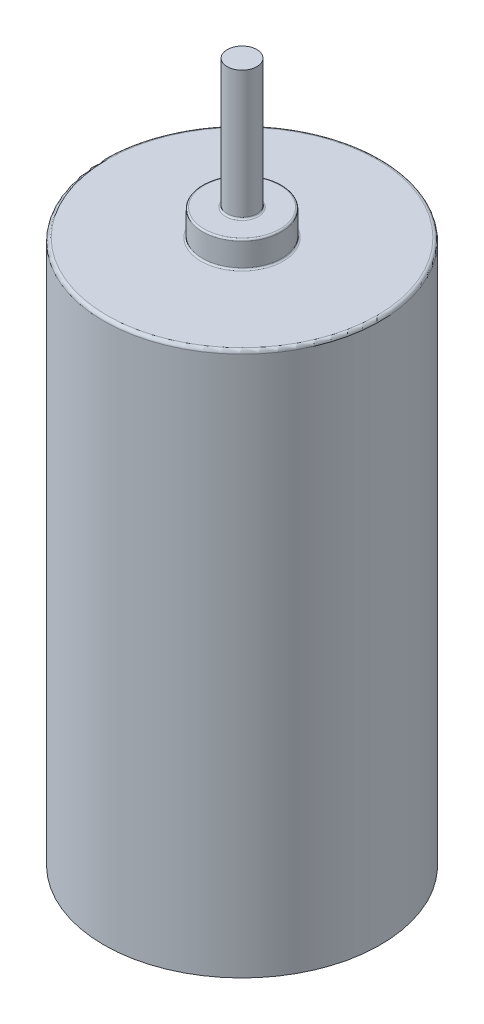
ISO-10303-21;
HEADER;
FILE_DESCRIPTION(('STEP AP214'),'2;1');
FILE_NAME('part.step','',(''),(''),'','','');
FILE_SCHEMA(('AUTOMOTIVE_DESIGN { 1 0 10303 214 1 1 1 1 }'));
ENDSEC;
DATA;
#1=APPLICATION_CONTEXT('core data for automotive mechanical design processes');
#2=APPLICATION_PROTOCOL_DEFINITION('international standard','automotive_design',2000,#1);
#3=PRODUCT_CONTEXT('',#1,'mechanical');
#4=PRODUCT('Part','Part','',(#3));
#5=PRODUCT_RELATED_PRODUCT_CATEGORY('part','',(#4));
#6=PRODUCT_DEFINITION_FORMATION('','',#4);
#7=PRODUCT_DEFINITION_CONTEXT('part definition',#1,'design');
#8=PRODUCT_DEFINITION('design','',#6,#7);
#9=PRODUCT_DEFINITION_SHAPE('','',#8);
#10=(LENGTH_UNIT() NAMED_UNIT(*) SI_UNIT(.MILLI.,.METRE.));
#11=(NAMED_UNIT(*) PLANE_ANGLE_UNIT() SI_UNIT($,.RADIAN.));
#12=(NAMED_UNIT(*) SI_UNIT($,.STERADIAN.) SOLID_ANGLE_UNIT());
#13=UNCERTAINTY_MEASURE_WITH_UNIT(LENGTH_MEASURE(1.E-05),#10,'distance_accuracy_value','');
#14=(GEOMETRIC_REPRESENTATION_CONTEXT(3) GLOBAL_UNCERTAINTY_ASSIGNED_CONTEXT((#13)) GLOBAL_UNIT_ASSIGNED_CONTEXT((#10,
#11,#12)) REPRESENTATION_CONTEXT('',''));
#15=CARTESIAN_POINT('',(0.,0.,0.));
#16=DIRECTION('',(0.,0.,1.));
#17=DIRECTION('',(1.,0.,0.));
#18=AXIS2_PLACEMENT_3D('',#15,#16,#17);
#19=CARTESIAN_POINT('',(0.,17.31,0.));
#20=DIRECTION('',(0.,1.,0.));
#21=DIRECTION('',(0.,0.,1.));
#22=AXIS2_PLACEMENT_3D('',#19,#20,#21);
#23=PLANE('',#22);
#24=CARTESIAN_POINT('',(0.,17.31,0.));
#25=DIRECTION('',(0.,1.,0.));
#26=DIRECTION('',(0.,0.,1.));
#27=AXIS2_PLACEMENT_3D('',#24,#25,#26);
#28=CIRCLE('',#27,0.5);
#29=CARTESIAN_POINT('',(0.,17.31,0.5));
#30=VERTEX_POINT('',#29);
#31=EDGE_CURVE('E42',#30,#30,#28,.F.);
#32=ORIENTED_EDGE('',*,*,#31,.T.);
#33=EDGE_LOOP('',(#32));
#34=FACE_BOUND('',#33,.T.);
#35=CARTESIAN_POINT('',(0.,17.31,0.));
#36=DIRECTION('',(0.,1.,0.));
#37=DIRECTION('',(0.,0.,1.));
#38=AXIS2_PLACEMENT_3D('',#35,#36,#37);
#39=CIRCLE('',#38,1.15);
#40=CARTESIAN_POINT('',(0.,17.31,1.15));
#41=VERTEX_POINT('',#40);
#42=EDGE_CURVE('E46',#41,#41,#39,.T.);
#43=ORIENTED_EDGE('',*,*,#42,.T.);
#44=EDGE_LOOP('',(#43));
#45=FACE_BOUND('',#44,.T.);
#46=ADVANCED_FACE('F31',(#34,#45),#23,.T.);
#47=CARTESIAN_POINT('',(0.,16.51,0.));
#48=DIRECTION('',(0.,1.,0.));
#49=DIRECTION('',(0.,0.,1.));
#50=AXIS2_PLACEMENT_3D('',#47,#48,#49);
#51=PLANE('',#50);
#52=CARTESIAN_POINT('',(0.,16.51,0.));
#53=DIRECTION('',(0.,1.,0.));
#54=DIRECTION('',(0.,0.,1.));
#55=AXIS2_PLACEMENT_3D('',#52,#53,#54);
#56=CIRCLE('',#55,4.1);
#57=CARTESIAN_POINT('',(0.,16.51,4.1));
#58=VERTEX_POINT('',#57);
#59=EDGE_CURVE('E38',#58,#58,#56,.T.);
#60=ORIENTED_EDGE('',*,*,#59,.T.);
#61=EDGE_LOOP('',(#60));
#62=FACE_BOUND('',#61,.T.);
#63=CARTESIAN_POINT('',(0.,16.51,0.));
#64=DIRECTION('',(0.,1.,0.));
#65=DIRECTION('',(0.,0.,1.));
#66=AXIS2_PLACEMENT_3D('',#63,#64,#65);
#67=CIRCLE('',#66,1.25);
#68=CARTESIAN_POINT('',(0.,16.51,1.25));
#69=VERTEX_POINT('',#68);
#70=EDGE_CURVE('E54',#69,#69,#67,.F.);
#71=ORIENTED_EDGE('',*,*,#70,.T.);
#72=EDGE_LOOP('',(#71));
#73=FACE_BOUND('',#72,.T.);
#74=ADVANCED_FACE('F88',(#62,#73),#51,.T.);
#75=CARTESIAN_POINT('',(0.,16.51,0.));
#76=DIRECTION('',(0.,-1.,0.));
#77=DIRECTION('',(0.,0.,-1.));
#78=AXIS2_PLACEMENT_3D('',#75,#76,#77);
#79=CYLINDRICAL_SURFACE('',#78,4.2);
#80=CARTESIAN_POINT('',(0.,16.41,0.));
#81=DIRECTION('',(0.,1.,0.));
#82=DIRECTION('',(0.,0.,1.));
#83=AXIS2_PLACEMENT_3D('',#80,#81,#82);
#84=CIRCLE('',#83,4.2);
#85=CARTESIAN_POINT('',(0.,16.41,4.2));
#86=VERTEX_POINT('',#85);
#87=EDGE_CURVE('E10',#86,#86,#84,.F.);
#88=ORIENTED_EDGE('',*,*,#87,.T.);
#89=EDGE_LOOP('',(#88));
#90=FACE_BOUND('',#89,.T.);
#91=CARTESIAN_POINT('',(0.,0.,0.));
#92=DIRECTION('',(0.,1.,0.));
#93=DIRECTION('',(0.,0.,1.));
#94=AXIS2_PLACEMENT_3D('',#91,#92,#93);
#95=CIRCLE('',#94,4.2);
#96=CARTESIAN_POINT('',(0.,0.,4.2));
#97=VERTEX_POINT('',#96);
#98=EDGE_CURVE('E63',#97,#97,#95,.T.);
#99=ORIENTED_EDGE('',*,*,#98,.T.);
#100=EDGE_LOOP('',(#99));
#101=FACE_BOUND('',#100,.T.);
#102=ADVANCED_FACE('F93',(#90,#101),#79,.T.);
#103=CARTESIAN_POINT('',(0.,0.,0.));
#104=DIRECTION('',(0.,1.,0.));
#105=DIRECTION('',(0.,0.,1.));
#106=AXIS2_PLACEMENT_3D('',#103,#104,#105);
#107=PLANE('',#106);
#108=ORIENTED_EDGE('',*,*,#98,.F.);
#109=EDGE_LOOP('',(#108));
#110=FACE_BOUND('',#109,.T.);
#111=ADVANCED_FACE('F83',(#110),#107,.F.);
#112=CARTESIAN_POINT('',(0.,17.31,0.));
#113=DIRECTION('',(0.,-1.,0.));
#114=DIRECTION('',(0.,0.,-1.));
#115=AXIS2_PLACEMENT_3D('',#112,#113,#114);
#116=CYLINDRICAL_SURFACE('',#115,1.2);
#117=CARTESIAN_POINT('',(0.,16.56,0.));
#118=DIRECTION('',(0.,1.,0.));
#119=DIRECTION('',(0.,0.,1.));
#120=AXIS2_PLACEMENT_3D('',#117,#118,#119);
#121=CIRCLE('',#120,1.2);
#122=CARTESIAN_POINT('',(0.,16.56,1.2));
#123=VERTEX_POINT('',#122);
#124=EDGE_CURVE('E57',#123,#123,#121,.T.);
#125=ORIENTED_EDGE('',*,*,#124,.T.);
#126=EDGE_LOOP('',(#125));
#127=FACE_BOUND('',#126,.T.);
#128=CARTESIAN_POINT('',(0.,17.26,0.));
#129=DIRECTION('',(0.,1.,0.));
#130=DIRECTION('',(0.,0.,1.));
#131=AXIS2_PLACEMENT_3D('',#128,#129,#130);
#132=CIRCLE('',#131,1.2);
#133=CARTESIAN_POINT('',(0.,17.26,1.2));
#134=VERTEX_POINT('',#133);
#135=EDGE_CURVE('E60',#134,#134,#132,.F.);
#136=ORIENTED_EDGE('',*,*,#135,.T.);
#137=EDGE_LOOP('',(#136));
#138=FACE_BOUND('',#137,.T.);
#139=ADVANCED_FACE('F74',(#127,#138),#116,.T.);
#140=CARTESIAN_POINT('',(0.,21.23,0.));
#141=DIRECTION('',(0.,-1.,0.));
#142=DIRECTION('',(0.,0.,-1.));
#143=AXIS2_PLACEMENT_3D('',#140,#141,#142);
#144=CYLINDRICAL_SURFACE('',#143,0.45);
#145=CARTESIAN_POINT('',(0.,17.36,0.));
#146=DIRECTION('',(0.,1.,0.));
#147=DIRECTION('',(0.,0.,1.));
#148=AXIS2_PLACEMENT_3D('',#145,#146,#147);
#149=CIRCLE('',#148,0.45);
#150=CARTESIAN_POINT('',(0.,17.36,0.45));
#151=VERTEX_POINT('',#150);
#152=EDGE_CURVE('E51',#151,#151,#149,.T.);
#153=ORIENTED_EDGE('',*,*,#152,.T.);
#154=EDGE_LOOP('',(#153));
#155=FACE_BOUND('',#154,.T.);
#156=CARTESIAN_POINT('',(0.,21.23,0.));
#157=DIRECTION('',(0.,1.,0.));
#158=DIRECTION('',(0.,0.,1.));
#159=AXIS2_PLACEMENT_3D('',#156,#157,#158);
#160=CIRCLE('',#159,0.45);
#161=CARTESIAN_POINT('',(0.,21.23,0.45));
#162=VERTEX_POINT('',#161);
#163=EDGE_CURVE('E66',#162,#162,#160,.T.);
#164=ORIENTED_EDGE('',*,*,#163,.F.);
#165=EDGE_LOOP('',(#164));
#166=FACE_BOUND('',#165,.T.);
#167=ADVANCED_FACE('F72',(#155,#166),#144,.T.);
#168=CARTESIAN_POINT('',(0.,21.23,0.));
#169=DIRECTION('',(0.,1.,0.));
#170=DIRECTION('',(0.,0.,1.));
#171=AXIS2_PLACEMENT_3D('',#168,#169,#170);
#172=PLANE('',#171);
#173=ORIENTED_EDGE('',*,*,#163,.T.);
#174=EDGE_LOOP('',(#173));
#175=FACE_BOUND('',#174,.T.);
#176=ADVANCED_FACE('F70',(#175),#172,.T.);
#177=CARTESIAN_POINT('',(0.,16.56,0.));
#178=DIRECTION('',(0.,1.,0.));
#179=DIRECTION('',(0.,0.,1.));
#180=AXIS2_PLACEMENT_3D('',#177,#178,#179);
#181=TOROIDAL_SURFACE('',#180,1.25,0.05);
#182=ORIENTED_EDGE('',*,*,#70,.F.);
#183=EDGE_LOOP('',(#182));
#184=FACE_BOUND('',#183,.T.);
#185=ORIENTED_EDGE('',*,*,#124,.F.);
#186=EDGE_LOOP('',(#185));
#187=FACE_BOUND('',#186,.T.);
#188=ADVANCED_FACE('F81',(#184,#187),#181,.F.);
#189=CARTESIAN_POINT('',(0.,17.36,0.));
#190=DIRECTION('',(0.,1.,0.));
#191=DIRECTION('',(0.,0.,1.));
#192=AXIS2_PLACEMENT_3D('',#189,#190,#191);
#193=TOROIDAL_SURFACE('',#192,0.5,0.05);
#194=ORIENTED_EDGE('',*,*,#31,.F.);
#195=EDGE_LOOP('',(#194));
#196=FACE_BOUND('',#195,.T.);
#197=ORIENTED_EDGE('',*,*,#152,.F.);
#198=EDGE_LOOP('',(#197));
#199=FACE_BOUND('',#198,.T.);
#200=ADVANCED_FACE('F104',(#196,#199),#193,.F.);
#201=CARTESIAN_POINT('',(0.,17.26,0.));
#202=DIRECTION('',(0.,1.,0.));
#203=DIRECTION('',(0.,0.,1.));
#204=AXIS2_PLACEMENT_3D('',#201,#202,#203);
#205=TOROIDAL_SURFACE('',#204,1.15,0.05);
#206=ORIENTED_EDGE('',*,*,#135,.F.);
#207=EDGE_LOOP('',(#206));
#208=FACE_BOUND('',#207,.T.);
#209=ORIENTED_EDGE('',*,*,#42,.F.);
#210=EDGE_LOOP('',(#209));
#211=FACE_BOUND('',#210,.T.);
#212=ADVANCED_FACE('F107',(#208,#211),#205,.T.);
#213=CARTESIAN_POINT('',(0.,16.41,0.));
#214=DIRECTION('',(0.,1.,0.));
#215=DIRECTION('',(0.,0.,1.));
#216=AXIS2_PLACEMENT_3D('',#213,#214,#215);
#217=TOROIDAL_SURFACE('',#216,4.1,0.1);
#218=ORIENTED_EDGE('',*,*,#87,.F.);
#219=EDGE_LOOP('',(#218));
#220=FACE_BOUND('',#219,.T.);
#221=ORIENTED_EDGE('',*,*,#59,.F.);
#222=EDGE_LOOP('',(#221));
#223=FACE_BOUND('',#222,.T.);
#224=ADVANCED_FACE('F33',(#220,#223),#217,.T.);
#225=CLOSED_SHELL('',(#46,#74,#102,#111,#139,#167,#176,#188,#200,#212,#224));
#226=MANIFOLD_SOLID_BREP('B2',#225);
#227=ADVANCED_BREP_SHAPE_REPRESENTATION('',(#18,#226),#14);
#228=SHAPE_DEFINITION_REPRESENTATION(#9,#227);
ENDSEC;
END-ISO-10303-21;
